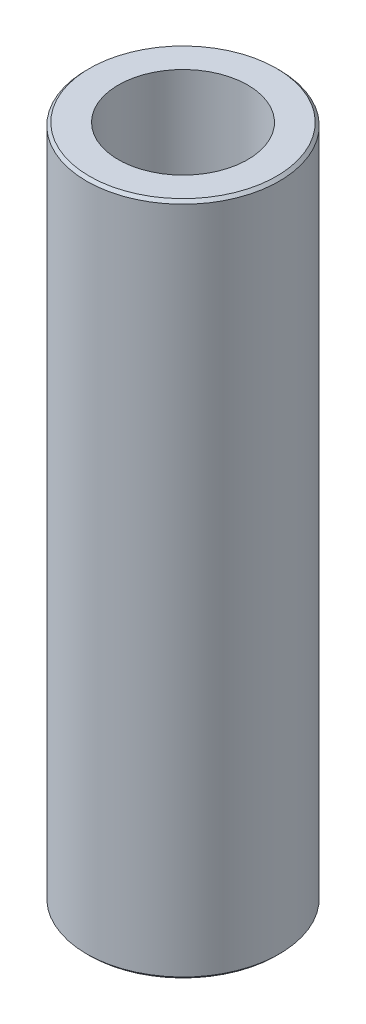
ISO-10303-21;
HEADER;
FILE_DESCRIPTION(('STEP AP214'),'2;1');
FILE_NAME('part.step','',(''),(''),'','','');
FILE_SCHEMA(('AUTOMOTIVE_DESIGN { 1 0 10303 214 1 1 1 1 }'));
ENDSEC;
DATA;
#1=APPLICATION_CONTEXT('core data for automotive mechanical design processes');
#2=APPLICATION_PROTOCOL_DEFINITION('international standard','automotive_design',2000,#1);
#3=PRODUCT_CONTEXT('',#1,'mechanical');
#4=PRODUCT('Part','Part','',(#3));
#5=PRODUCT_RELATED_PRODUCT_CATEGORY('part','',(#4));
#6=PRODUCT_DEFINITION_FORMATION('','',#4);
#7=PRODUCT_DEFINITION_CONTEXT('part definition',#1,'design');
#8=PRODUCT_DEFINITION('design','',#6,#7);
#9=PRODUCT_DEFINITION_SHAPE('','',#8);
#10=(LENGTH_UNIT() NAMED_UNIT(*) SI_UNIT(.MILLI.,.METRE.));
#11=(NAMED_UNIT(*) PLANE_ANGLE_UNIT() SI_UNIT($,.RADIAN.));
#12=(NAMED_UNIT(*) SI_UNIT($,.STERADIAN.) SOLID_ANGLE_UNIT());
#13=UNCERTAINTY_MEASURE_WITH_UNIT(LENGTH_MEASURE(1.E-05),#10,'distance_accuracy_value','');
#14=(GEOMETRIC_REPRESENTATION_CONTEXT(3) GLOBAL_UNCERTAINTY_ASSIGNED_CONTEXT((#13)) GLOBAL_UNIT_ASSIGNED_CONTEXT((#10,
#11,#12)) REPRESENTATION_CONTEXT('',''));
#15=CARTESIAN_POINT('',(0.,0.,0.));
#16=DIRECTION('',(0.,0.,1.));
#17=DIRECTION('',(1.,0.,0.));
#18=AXIS2_PLACEMENT_3D('',#15,#16,#17);
#19=CARTESIAN_POINT('',(0.,245.194889596807,0.));
#20=DIRECTION('',(0.,-1.,0.));
#21=DIRECTION('',(0.,0.,-1.));
#22=AXIS2_PLACEMENT_3D('',#19,#20,#21);
#23=CYLINDRICAL_SURFACE('',#22,35.);
#24=CARTESIAN_POINT('',(0.,244.162459908995,0.));
#25=DIRECTION('',(0.,1.,0.));
#26=DIRECTION('',(0.,0.,1.));
#27=AXIS2_PLACEMENT_3D('',#24,#25,#26);
#28=CIRCLE('',#27,35.);
#29=CARTESIAN_POINT('',(0.,244.162459908995,-35.));
#30=VERTEX_POINT('',#29);
#31=EDGE_CURVE('E50',#30,#30,#28,.F.);
#32=CARTESIAN_POINT('',(0.,1.03242968781231,0.));
#33=DIRECTION('',(0.,1.,0.));
#34=DIRECTION('',(0.,0.,1.));
#35=AXIS2_PLACEMENT_3D('',#32,#33,#34);
#36=CIRCLE('',#35,35.);
#37=CARTESIAN_POINT('',(0.,1.03242968781231,-35.));
#38=VERTEX_POINT('',#37);
#39=EDGE_CURVE('E51',#38,#38,#36,.T.);
#40=CARTESIAN_POINT('',(0.,244.162459908995,-35.));
#41=CARTESIAN_POINT('',(0.,241.629855427525,-35.));
#42=CARTESIAN_POINT('',(0.,239.097250946054,-35.));
#43=CARTESIAN_POINT('',(0.,234.032041983113,-35.));
#44=CARTESIAN_POINT('',(0.,231.499437501642,-35.));
#45=CARTESIAN_POINT('',(0.,226.434228538701,-35.));
#46=CARTESIAN_POINT('',(0.,223.90162405723,-35.));
#47=CARTESIAN_POINT('',(0.,218.836415094289,-35.));
#48=CARTESIAN_POINT('',(0.,216.303810612818,-35.));
#49=CARTESIAN_POINT('',(0.,211.238601649877,-35.));
#50=CARTESIAN_POINT('',(0.,208.705997168406,-35.));
#51=CARTESIAN_POINT('',(0.,203.640788205465,-35.));
#52=CARTESIAN_POINT('',(0.,201.108183723994,-35.));
#53=CARTESIAN_POINT('',(0.,196.042974761053,-35.));
#54=CARTESIAN_POINT('',(0.,193.510370279582,-35.));
#55=CARTESIAN_POINT('',(0.,188.445161316641,-35.));
#56=CARTESIAN_POINT('',(0.,185.91255683517,-35.));
#57=CARTESIAN_POINT('',(0.,180.847347872229,-35.));
#58=CARTESIAN_POINT('',(0.,178.314743390758,-35.));
#59=CARTESIAN_POINT('',(0.,173.249534427817,-35.));
#60=CARTESIAN_POINT('',(0.,170.716929946346,-35.));
#61=CARTESIAN_POINT('',(0.,165.651720983405,-35.));
#62=CARTESIAN_POINT('',(0.,163.119116501934,-35.));
#63=CARTESIAN_POINT('',(0.,158.053907538993,-35.));
#64=CARTESIAN_POINT('',(0.,155.521303057522,-35.));
#65=CARTESIAN_POINT('',(0.,150.456094094581,-35.));
#66=CARTESIAN_POINT('',(0.,147.92348961311,-35.));
#67=CARTESIAN_POINT('',(0.,142.858280650169,-35.));
#68=CARTESIAN_POINT('',(0.,140.325676168698,-35.));
#69=CARTESIAN_POINT('',(0.,135.260467205757,-35.));
#70=CARTESIAN_POINT('',(0.,132.727862724286,-35.));
#71=CARTESIAN_POINT('',(0.,127.662653761345,-35.));
#72=CARTESIAN_POINT('',(0.,125.130049279874,-35.));
#73=CARTESIAN_POINT('',(0.,120.064840316933,-35.));
#74=CARTESIAN_POINT('',(0.,117.532235835463,-35.));
#75=CARTESIAN_POINT('',(0.,112.467026872521,-35.));
#76=CARTESIAN_POINT('',(0.,109.934422391051,-35.));
#77=CARTESIAN_POINT('',(0.,104.869213428109,-35.));
#78=CARTESIAN_POINT('',(0.,102.336608946639,-35.));
#79=CARTESIAN_POINT('',(0.,97.2713999836973,-35.));
#80=CARTESIAN_POINT('',(0.,94.7387955022266,-35.));
#81=CARTESIAN_POINT('',(0.,89.6735865392853,-35.));
#82=CARTESIAN_POINT('',(0.,87.1409820578146,-35.));
#83=CARTESIAN_POINT('',(0.,82.0757730948733,-35.));
#84=CARTESIAN_POINT('',(0.,79.5431686134026,-35.));
#85=CARTESIAN_POINT('',(0.,74.4779596504613,-35.));
#86=CARTESIAN_POINT('',(0.,71.9453551689907,-35.));
#87=CARTESIAN_POINT('',(0.,66.8801462060494,-35.));
#88=CARTESIAN_POINT('',(0.,64.3475417245787,-35.));
#89=CARTESIAN_POINT('',(0.,59.2823327616374,-35.));
#90=CARTESIAN_POINT('',(0.,56.7497282801667,-35.));
#91=CARTESIAN_POINT('',(0.,51.6845193172254,-35.));
#92=CARTESIAN_POINT('',(0.,49.1519148357548,-35.));
#93=CARTESIAN_POINT('',(0.,44.0867058728135,-35.));
#94=CARTESIAN_POINT('',(0.,41.5541013913428,-35.));
#95=CARTESIAN_POINT('',(0.,36.4888924284015,-35.));
#96=CARTESIAN_POINT('',(0.,33.9562879469308,-35.));
#97=CARTESIAN_POINT('',(0.,28.8910789839895,-35.));
#98=CARTESIAN_POINT('',(0.,26.3584745025189,-35.));
#99=CARTESIAN_POINT('',(0.,21.2932655395776,-35.));
#100=CARTESIAN_POINT('',(0.,18.7606610581069,-35.));
#101=CARTESIAN_POINT('',(0.,13.6954520951656,-35.));
#102=CARTESIAN_POINT('',(0.,11.1628476136949,-35.));
#103=CARTESIAN_POINT('',(0.,6.09763865075362,-35.));
#104=CARTESIAN_POINT('',(0.,3.56503416928296,-35.));
#105=CARTESIAN_POINT('',(0.,1.03242968781231,-35.));
#106=B_SPLINE_CURVE_WITH_KNOTS('',3,(#40,#41,#42,#43,#44,#45,#46,#47,#48,#49,#50,#51,#52,#53,
#54,#55,#56,#57,#58,#59,#60,#61,#62,#63,#64,#65,#66,#67,#68,#69,#70,#71,#72,#73,#74,#75,#76,#77,
#78,#79,#80,#81,#82,#83,#84,#85,#86,#87,#88,#89,#90,#91,#92,#93,#94,#95,#96,#97,#98,#99,#100,
#101,#102,#103,#104,#105),.UNSPECIFIED.,.F.,.F.,(4,2,2,2,2,2,2,2,2,2,2,2,2,2,2,2,2,2,2,2,2,2,2,
2,2,2,2,2,2,2,2,2,4),(0.,7.59781344441196,15.1956268888239,22.7934403332359,30.3912537776479,
37.9890672220598,45.5868806664718,53.1846941108838,60.7825075552957,68.3803209997077,
75.9781344441197,83.5759478885316,91.1737613329436,98.7715747773556,106.369388221768,
113.967201666179,121.565015110591,129.162828555003,136.760641999415,144.358455443827,
151.956268888239,159.554082332651,167.151895777063,174.749709221475,182.347522665887,
189.945336110299,197.543149554711,205.140962999123,212.738776443535,220.336589887947,
227.934403332359,235.532216776771,243.130030221183),.UNSPECIFIED.);
#107=EDGE_CURVE('BSEAM39',#30,#38,#106,.T.);
#108=ORIENTED_EDGE('',*,*,#31,.T.);
#109=ORIENTED_EDGE('',*,*,#39,.T.);
#110=ORIENTED_EDGE('',*,*,#107,.T.);
#111=ORIENTED_EDGE('',*,*,#107,.F.);
#112=EDGE_LOOP('',(#108,#110,#109,#111));
#113=FACE_BOUND('',#112,.T.);
#114=ADVANCED_FACE('F39',(#113),#23,.T.);
#115=CARTESIAN_POINT('',(0.,245.194889596807,0.));
#116=DIRECTION('',(0.,1.,0.));
#117=DIRECTION('',(0.,0.,1.));
#118=AXIS2_PLACEMENT_3D('',#115,#116,#117);
#119=PLANE('',#118);
#120=CARTESIAN_POINT('',(0.,245.194889596807,0.));
#121=DIRECTION('',(0.,1.,0.));
#122=DIRECTION('',(0.,0.,1.));
#123=AXIS2_PLACEMENT_3D('',#120,#121,#122);
#124=CIRCLE('',#123,33.9675703121881);
#125=CARTESIAN_POINT('',(0.,245.194889596807,33.9675703121881));
#126=VERTEX_POINT('',#125);
#127=EDGE_CURVE('E54',#126,#126,#124,.T.);
#128=ORIENTED_EDGE('',*,*,#127,.T.);
#129=EDGE_LOOP('',(#128));
#130=FACE_BOUND('',#129,.T.);
#131=CARTESIAN_POINT('',(0.,245.194889596807,0.));
#132=DIRECTION('',(0.,1.,0.));
#133=DIRECTION('',(0.,0.,1.));
#134=AXIS2_PLACEMENT_3D('',#131,#132,#133);
#135=CIRCLE('',#134,23.5098631429291);
#136=CARTESIAN_POINT('',(0.,245.194889596807,-23.5098631429291));
#137=VERTEX_POINT('',#136);
#138=EDGE_CURVE('E58',#137,#137,#135,.T.);
#139=ORIENTED_EDGE('',*,*,#138,.F.);
#140=EDGE_LOOP('',(#139));
#141=FACE_BOUND('',#140,.T.);
#142=ADVANCED_FACE('F69',(#130,#141),#119,.T.);
#143=CARTESIAN_POINT('',(0.,0.,0.));
#144=DIRECTION('',(0.,1.,0.));
#145=DIRECTION('',(0.,0.,1.));
#146=AXIS2_PLACEMENT_3D('',#143,#144,#145);
#147=PLANE('',#146);
#148=CARTESIAN_POINT('',(0.,0.,0.));
#149=DIRECTION('',(0.,1.,0.));
#150=DIRECTION('',(0.,0.,1.));
#151=AXIS2_PLACEMENT_3D('',#148,#149,#150);
#152=CIRCLE('',#151,33.9675703121877);
#153=CARTESIAN_POINT('',(0.,0.,33.9675703121877));
#154=VERTEX_POINT('',#153);
#155=EDGE_CURVE('E10',#154,#154,#152,.F.);
#156=ORIENTED_EDGE('',*,*,#155,.T.);
#157=EDGE_LOOP('',(#156));
#158=FACE_BOUND('',#157,.T.);
#159=CARTESIAN_POINT('',(0.,0.,0.));
#160=DIRECTION('',(0.,1.,0.));
#161=DIRECTION('',(0.,0.,1.));
#162=AXIS2_PLACEMENT_3D('',#159,#160,#161);
#163=CIRCLE('',#162,23.5098631429291);
#164=CARTESIAN_POINT('',(0.,0.,-23.5098631429291));
#165=VERTEX_POINT('',#164);
#166=EDGE_CURVE('E63',#165,#165,#163,.T.);
#167=ORIENTED_EDGE('',*,*,#166,.T.);
#168=EDGE_LOOP('',(#167));
#169=FACE_BOUND('',#168,.T.);
#170=ADVANCED_FACE('F75',(#158,#169),#147,.F.);
#171=CARTESIAN_POINT('',(0.,245.194889596807,0.));
#172=DIRECTION('',(0.,-1.,0.));
#173=DIRECTION('',(0.,0.,-1.));
#174=AXIS2_PLACEMENT_3D('',#171,#172,#173);
#175=CYLINDRICAL_SURFACE('',#174,23.5098631429291);
#176=CARTESIAN_POINT('',(0.,245.194889596807,-23.5098631429291));
#177=CARTESIAN_POINT('',(0.,242.640776163507,-23.5098631429291));
#178=CARTESIAN_POINT('',(0.,240.086662730207,-23.5098631429291));
#179=CARTESIAN_POINT('',(0.,234.978435863607,-23.5098631429291));
#180=CARTESIAN_POINT('',(0.,232.424322430307,-23.5098631429291));
#181=CARTESIAN_POINT('',(0.,227.316095563707,-23.5098631429291));
#182=CARTESIAN_POINT('',(0.,224.761982130407,-23.5098631429291));
#183=CARTESIAN_POINT('',(0.,219.653755263807,-23.5098631429291));
#184=CARTESIAN_POINT('',(0.,217.099641830506,-23.5098631429291));
#185=CARTESIAN_POINT('',(0.,211.991414963906,-23.5098631429291));
#186=CARTESIAN_POINT('',(0.,209.437301530606,-23.5098631429291));
#187=CARTESIAN_POINT('',(0.,204.329074664006,-23.5098631429291));
#188=CARTESIAN_POINT('',(0.,201.774961230706,-23.5098631429291));
#189=CARTESIAN_POINT('',(0.,196.666734364106,-23.5098631429291));
#190=CARTESIAN_POINT('',(0.,194.112620930806,-23.5098631429291));
#191=CARTESIAN_POINT('',(0.,189.004394064206,-23.5098631429291));
#192=CARTESIAN_POINT('',(0.,186.450280630906,-23.5098631429291));
#193=CARTESIAN_POINT('',(0.,181.342053764305,-23.5098631429291));
#194=CARTESIAN_POINT('',(0.,178.787940331005,-23.5098631429291));
#195=CARTESIAN_POINT('',(0.,173.679713464405,-23.5098631429291));
#196=CARTESIAN_POINT('',(0.,171.125600031105,-23.5098631429291));
#197=CARTESIAN_POINT('',(0.,166.017373164505,-23.5098631429291));
#198=CARTESIAN_POINT('',(0.,163.463259731205,-23.5098631429291));
#199=CARTESIAN_POINT('',(0.,158.355032864605,-23.5098631429291));
#200=CARTESIAN_POINT('',(0.,155.800919431305,-23.5098631429291));
#201=CARTESIAN_POINT('',(0.,150.692692564704,-23.5098631429291));
#202=CARTESIAN_POINT('',(0.,148.138579131404,-23.5098631429291));
#203=CARTESIAN_POINT('',(0.,143.030352264804,-23.5098631429291));
#204=CARTESIAN_POINT('',(0.,140.476238831504,-23.5098631429291));
#205=CARTESIAN_POINT('',(0.,135.368011964904,-23.5098631429291));
#206=CARTESIAN_POINT('',(0.,132.813898531604,-23.5098631429291));
#207=CARTESIAN_POINT('',(0.,127.705671665004,-23.5098631429291));
#208=CARTESIAN_POINT('',(0.,125.151558231704,-23.5098631429291));
#209=CARTESIAN_POINT('',(0.,120.043331365104,-23.5098631429291));
#210=CARTESIAN_POINT('',(0.,117.489217931803,-23.5098631429291));
#211=CARTESIAN_POINT('',(0.,112.380991065203,-23.5098631429291));
#212=CARTESIAN_POINT('',(0.,109.826877631903,-23.5098631429291));
#213=CARTESIAN_POINT('',(0.,104.718650765303,-23.5098631429291));
#214=CARTESIAN_POINT('',(0.,102.164537332003,-23.5098631429291));
#215=CARTESIAN_POINT('',(0.,97.0563104654029,-23.5098631429291));
#216=CARTESIAN_POINT('',(0.,94.5021970321028,-23.5098631429291));
#217=CARTESIAN_POINT('',(0.,89.3939701655026,-23.5098631429291));
#218=CARTESIAN_POINT('',(0.,86.8398567322026,-23.5098631429291));
#219=CARTESIAN_POINT('',(0.,81.7316298656024,-23.5098631429291));
#220=CARTESIAN_POINT('',(0.,79.1775164323024,-23.5098631429291));
#221=CARTESIAN_POINT('',(0.,74.0692895657022,-23.5098631429291));
#222=CARTESIAN_POINT('',(0.,71.5151761324021,-23.5098631429291));
#223=CARTESIAN_POINT('',(0.,66.406949265802,-23.5098631429291));
#224=CARTESIAN_POINT('',(0.,63.8528358325019,-23.5098631429291));
#225=CARTESIAN_POINT('',(0.,58.7446089659017,-23.5098631429291));
#226=CARTESIAN_POINT('',(0.,56.1904955326017,-23.5098631429291));
#227=CARTESIAN_POINT('',(0.,51.0822686660015,-23.5098631429291));
#228=CARTESIAN_POINT('',(0.,48.5281552327014,-23.5098631429291));
#229=CARTESIAN_POINT('',(0.,43.4199283661013,-23.5098631429291));
#230=CARTESIAN_POINT('',(0.,40.8658149328012,-23.5098631429291));
#231=CARTESIAN_POINT('',(0.,35.7575880662011,-23.5098631429291));
#232=CARTESIAN_POINT('',(0.,33.203474632901,-23.5098631429291));
#233=CARTESIAN_POINT('',(0.,28.0952477663008,-23.5098631429291));
#234=CARTESIAN_POINT('',(0.,25.5411343330007,-23.5098631429291));
#235=CARTESIAN_POINT('',(0.,20.4329074664006,-23.5098631429291));
#236=CARTESIAN_POINT('',(0.,17.8787940331005,-23.5098631429291));
#237=CARTESIAN_POINT('',(0.,12.7705671665004,-23.5098631429291));
#238=CARTESIAN_POINT('',(0.,10.2164537332003,-23.5098631429291));
#239=CARTESIAN_POINT('',(0.,5.10822686660016,-23.5098631429291));
#240=CARTESIAN_POINT('',(0.,2.55411343330008,-23.5098631429291));
#241=CARTESIAN_POINT('',(0.,0.,-23.5098631429291));
#242=B_SPLINE_CURVE_WITH_KNOTS('',3,(#176,#177,#178,#179,#180,#181,#182,#183,#184,#185,#186,
#187,#188,#189,#190,#191,#192,#193,#194,#195,#196,#197,#198,#199,#200,#201,#202,#203,#204,#205,
#206,#207,#208,#209,#210,#211,#212,#213,#214,#215,#216,#217,#218,#219,#220,#221,#222,#223,#224,
#225,#226,#227,#228,#229,#230,#231,#232,#233,#234,#235,#236,#237,#238,#239,#240,#241),
.UNSPECIFIED.,.F.,.F.,(4,2,2,2,2,2,2,2,2,2,2,2,2,2,2,2,2,2,2,2,2,2,2,2,2,2,2,2,2,2,2,2,4),(0.,
7.66234029990021,15.3246805998004,22.9870208997007,30.6493611996009,38.3117014995011,
45.9740417994013,53.6363820993016,61.2987223992018,68.961062699102,76.6234029990023,
84.2857432989025,91.9480835988027,99.6104238987029,107.272764198603,114.935104498503,
122.597444798404,130.259785098304,137.922125398204,145.584465698104,153.246805998005,
160.909146297905,168.571486597805,176.233826897705,183.896167197605,191.558507497506,
199.220847797406,206.883188097306,214.545528397206,222.207868697107,229.870208997007,
237.532549296907,245.194889596807),.UNSPECIFIED.);
#243=EDGE_CURVE('BSEAM70',#137,#165,#242,.T.);
#244=ORIENTED_EDGE('',*,*,#138,.T.);
#245=ORIENTED_EDGE('',*,*,#166,.F.);
#246=ORIENTED_EDGE('',*,*,#243,.T.);
#247=ORIENTED_EDGE('',*,*,#243,.F.);
#248=EDGE_LOOP('',(#244,#246,#245,#247));
#249=FACE_BOUND('',#248,.T.);
#250=ADVANCED_FACE('F70',(#249),#175,.F.);
#251=CARTESIAN_POINT('',(0.,245.194889596807,0.));
#252=DIRECTION('',(0.,-1.,0.));
#253=DIRECTION('',(0.,0.,-1.));
#254=AXIS2_PLACEMENT_3D('',#251,#252,#253);
#255=CONICAL_SURFACE('',#254,33.9675703121881,0.785398163397442);
#256=ORIENTED_EDGE('',*,*,#31,.F.);
#257=EDGE_LOOP('',(#256));
#258=FACE_BOUND('',#257,.T.);
#259=ORIENTED_EDGE('',*,*,#127,.F.);
#260=EDGE_LOOP('',(#259));
#261=FACE_BOUND('',#260,.T.);
#262=ADVANCED_FACE('F81',(#258,#261),#255,.T.);
#263=CARTESIAN_POINT('',(0.,1.03242968781231,0.));
#264=DIRECTION('',(0.,1.,0.));
#265=DIRECTION('',(0.,0.,1.));
#266=AXIS2_PLACEMENT_3D('',#263,#264,#265);
#267=CONICAL_SURFACE('',#266,35.,0.785398163397442);
#268=ORIENTED_EDGE('',*,*,#155,.F.);
#269=EDGE_LOOP('',(#268));
#270=FACE_BOUND('',#269,.T.);
#271=ORIENTED_EDGE('',*,*,#39,.F.);
#272=EDGE_LOOP('',(#271));
#273=FACE_BOUND('',#272,.T.);
#274=ADVANCED_FACE('F45',(#270,#273),#267,.T.);
#275=CLOSED_SHELL('',(#114,#142,#170,#250,#262,#274));
#276=MANIFOLD_SOLID_BREP('B2',#275);
#277=ADVANCED_BREP_SHAPE_REPRESENTATION('',(#18,#276),#14);
#278=SHAPE_DEFINITION_REPRESENTATION(#9,#277);
ENDSEC;
END-ISO-10303-21;
